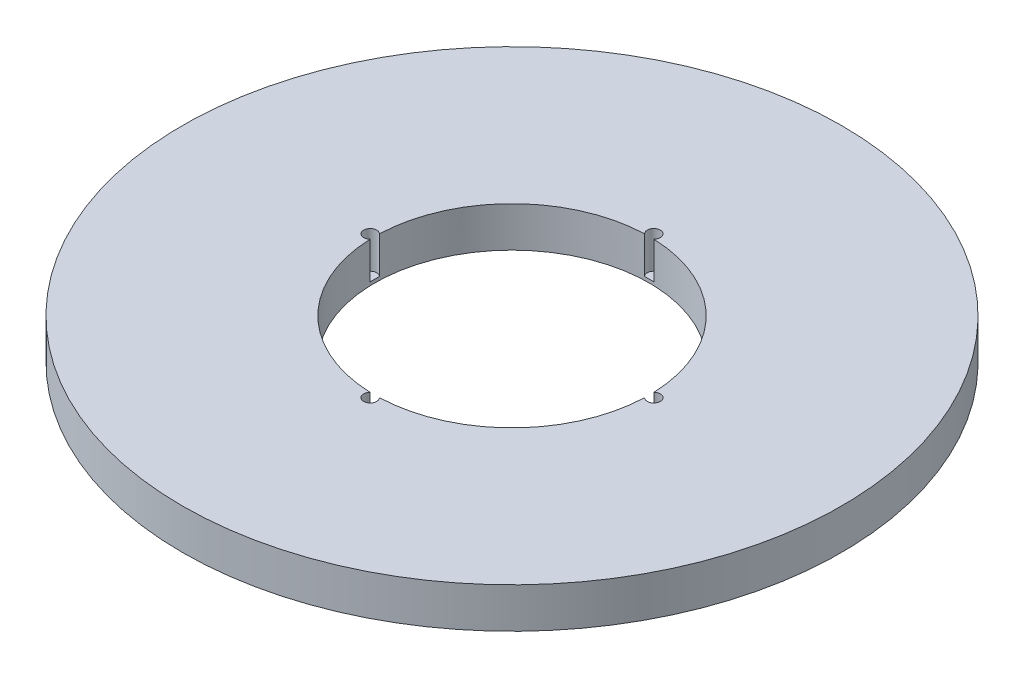
ISO-10303-21;
HEADER;
FILE_DESCRIPTION(('STEP AP214'),'2;1');
FILE_NAME('part.step','',(''),(''),'','','');
FILE_SCHEMA(('AUTOMOTIVE_DESIGN { 1 0 10303 214 1 1 1 1 }'));
ENDSEC;
DATA;
#1=APPLICATION_CONTEXT('core data for automotive mechanical design processes');
#2=APPLICATION_PROTOCOL_DEFINITION('international standard','automotive_design',2000,#1);
#3=PRODUCT_CONTEXT('',#1,'mechanical');
#4=PRODUCT('Part','Part','',(#3));
#5=PRODUCT_RELATED_PRODUCT_CATEGORY('part','',(#4));
#6=PRODUCT_DEFINITION_FORMATION('','',#4);
#7=PRODUCT_DEFINITION_CONTEXT('part definition',#1,'design');
#8=PRODUCT_DEFINITION('design','',#6,#7);
#9=PRODUCT_DEFINITION_SHAPE('','',#8);
#10=(LENGTH_UNIT() NAMED_UNIT(*) SI_UNIT(.MILLI.,.METRE.));
#11=(NAMED_UNIT(*) PLANE_ANGLE_UNIT() SI_UNIT($,.RADIAN.));
#12=(NAMED_UNIT(*) SI_UNIT($,.STERADIAN.) SOLID_ANGLE_UNIT());
#13=UNCERTAINTY_MEASURE_WITH_UNIT(LENGTH_MEASURE(1.E-05),#10,'distance_accuracy_value','');
#14=(GEOMETRIC_REPRESENTATION_CONTEXT(3) GLOBAL_UNCERTAINTY_ASSIGNED_CONTEXT((#13)) GLOBAL_UNIT_ASSIGNED_CONTEXT((#10,
#11,#12)) REPRESENTATION_CONTEXT('',''));
#15=CARTESIAN_POINT('',(0.,0.,0.));
#16=DIRECTION('',(0.,0.,1.));
#17=DIRECTION('',(1.,0.,0.));
#18=AXIS2_PLACEMENT_3D('',#15,#16,#17);
#19=CARTESIAN_POINT('',(0.,11.,0.));
#20=DIRECTION('',(0.,-1.,0.));
#21=DIRECTION('',(0.,0.,-1.));
#22=AXIS2_PLACEMENT_3D('',#19,#20,#21);
#23=CYLINDRICAL_SURFACE('',#22,90.);
#24=CARTESIAN_POINT('',(0.,11.,0.));
#25=DIRECTION('',(0.,1.,0.));
#26=DIRECTION('',(0.,0.,1.));
#27=AXIS2_PLACEMENT_3D('',#24,#25,#26);
#28=CIRCLE('',#27,90.);
#29=CARTESIAN_POINT('',(0.,11.,90.));
#30=VERTEX_POINT('',#29);
#31=EDGE_CURVE('E145',#30,#30,#28,.T.);
#32=ORIENTED_EDGE('',*,*,#31,.F.);
#33=EDGE_LOOP('',(#32));
#34=FACE_BOUND('',#33,.T.);
#35=CARTESIAN_POINT('',(0.,0.,0.));
#36=DIRECTION('',(0.,1.,0.));
#37=DIRECTION('',(0.,0.,1.));
#38=AXIS2_PLACEMENT_3D('',#35,#36,#37);
#39=CIRCLE('',#38,90.);
#40=CARTESIAN_POINT('',(0.,0.,90.));
#41=VERTEX_POINT('',#40);
#42=EDGE_CURVE('E143',#41,#41,#39,.T.);
#43=ORIENTED_EDGE('',*,*,#42,.T.);
#44=EDGE_LOOP('',(#43));
#45=FACE_BOUND('',#44,.T.);
#46=ADVANCED_FACE('F39',(#34,#45),#23,.T.);
#47=CARTESIAN_POINT('',(0.,11.,0.));
#48=DIRECTION('',(0.,1.,0.));
#49=DIRECTION('',(0.,0.,1.));
#50=AXIS2_PLACEMENT_3D('',#47,#48,#49);
#51=PLANE('',#50);
#52=CARTESIAN_POINT('',(1.35209274207174E-13,11.,38.7254752597286));
#53=DIRECTION('',(0.,1.,0.));
#54=DIRECTION('',(1.,0.,0.));
#55=AXIS2_PLACEMENT_3D('',#52,#53,#54);
#56=CIRCLE('',#55,1.79084642130694);
#57=CARTESIAN_POINT('',(-1.28486988663369,11.,37.4779816608955));
#58=VERTEX_POINT('',#57);
#59=CARTESIAN_POINT('',(1.28486988663395,11.,37.4779816608955));
#60=VERTEX_POINT('',#59);
#61=EDGE_CURVE('E152',#58,#60,#56,.T.);
#62=ORIENTED_EDGE('',*,*,#61,.F.);
#63=CARTESIAN_POINT('',(0.,11.,0.));
#64=DIRECTION('',(0.,1.,0.));
#65=DIRECTION('',(0.,0.,1.));
#66=AXIS2_PLACEMENT_3D('',#63,#64,#65);
#67=CIRCLE('',#66,37.5);
#68=CARTESIAN_POINT('',(-37.4779816608955,11.,1.28486988663382));
#69=VERTEX_POINT('',#68);
#70=EDGE_CURVE('E133',#69,#58,#67,.T.);
#71=ORIENTED_EDGE('',*,*,#70,.F.);
#72=CARTESIAN_POINT('',(-38.7254752597286,11.,0.));
#73=DIRECTION('',(0.,1.,0.));
#74=DIRECTION('',(0.,0.,1.));
#75=AXIS2_PLACEMENT_3D('',#72,#73,#74);
#76=CIRCLE('',#75,1.79084642130694);
#77=CARTESIAN_POINT('',(-37.4779816608955,11.,-1.28486988663382));
#78=VERTEX_POINT('',#77);
#79=EDGE_CURVE('E128',#78,#69,#76,.T.);
#80=ORIENTED_EDGE('',*,*,#79,.F.);
#81=CARTESIAN_POINT('',(-1.28486988663421,11.,-37.4779816608955));
#82=VERTEX_POINT('',#81);
#83=EDGE_CURVE('E121',#82,#78,#67,.T.);
#84=ORIENTED_EDGE('',*,*,#83,.F.);
#85=CARTESIAN_POINT('',(-4.05627822621521E-13,11.,-38.7254752597286));
#86=DIRECTION('',(0.,1.,0.));
#87=DIRECTION('',(-1.,0.,0.));
#88=AXIS2_PLACEMENT_3D('',#85,#86,#87);
#89=CIRCLE('',#88,1.79084642130694);
#90=CARTESIAN_POINT('',(1.28486988663343,11.,-37.4779816608955));
#91=VERTEX_POINT('',#90);
#92=EDGE_CURVE('E105',#91,#82,#89,.T.);
#93=ORIENTED_EDGE('',*,*,#92,.F.);
#94=CARTESIAN_POINT('',(37.4779816608955,11.,-1.28486988663382));
#95=VERTEX_POINT('',#94);
#96=EDGE_CURVE('E131',#95,#91,#67,.T.);
#97=ORIENTED_EDGE('',*,*,#96,.F.);
#98=CARTESIAN_POINT('',(38.7254752597286,11.,0.));
#99=DIRECTION('',(0.,1.,0.));
#100=DIRECTION('',(0.,0.,-1.));
#101=AXIS2_PLACEMENT_3D('',#98,#99,#100);
#102=CIRCLE('',#101,1.79084642130694);
#103=CARTESIAN_POINT('',(37.4779816608955,11.,1.28486988663382));
#104=VERTEX_POINT('',#103);
#105=EDGE_CURVE('E154',#104,#95,#102,.T.);
#106=ORIENTED_EDGE('',*,*,#105,.F.);
#107=EDGE_CURVE('E134',#60,#104,#67,.T.);
#108=ORIENTED_EDGE('',*,*,#107,.F.);
#109=EDGE_LOOP('',(#62,#71,#80,#84,#93,#97,#106,#108));
#110=FACE_BOUND('',#109,.T.);
#111=ORIENTED_EDGE('',*,*,#31,.T.);
#112=EDGE_LOOP('',(#111));
#113=FACE_BOUND('',#112,.T.);
#114=ADVANCED_FACE('F130',(#110,#113),#51,.T.);
#115=CARTESIAN_POINT('',(0.,0.,0.));
#116=DIRECTION('',(0.,1.,0.));
#117=DIRECTION('',(0.,0.,1.));
#118=AXIS2_PLACEMENT_3D('',#115,#116,#117);
#119=PLANE('',#118);
#120=CARTESIAN_POINT('',(0.,0.,0.));
#121=DIRECTION('',(0.,1.,0.));
#122=DIRECTION('',(0.,0.,1.));
#123=AXIS2_PLACEMENT_3D('',#120,#121,#122);
#124=CIRCLE('',#123,37.5);
#125=CARTESIAN_POINT('',(0.,0.,37.5));
#126=VERTEX_POINT('',#125);
#127=EDGE_CURVE('E135',#126,#126,#124,.T.);
#128=ORIENTED_EDGE('',*,*,#127,.T.);
#129=EDGE_LOOP('',(#128));
#130=FACE_BOUND('',#129,.T.);
#131=ORIENTED_EDGE('',*,*,#42,.F.);
#132=EDGE_LOOP('',(#131));
#133=FACE_BOUND('',#132,.T.);
#134=ADVANCED_FACE('F195',(#130,#133),#119,.F.);
#135=CARTESIAN_POINT('',(0.,11.,0.));
#136=DIRECTION('',(0.,-1.,0.));
#137=DIRECTION('',(0.,0.,-1.));
#138=AXIS2_PLACEMENT_3D('',#135,#136,#137);
#139=CYLINDRICAL_SURFACE('',#138,37.5);
#140=DIRECTION('',(0.,1.,0.));
#141=VECTOR('',#140,1.);
#142=CARTESIAN_POINT('',(-1.2848698866337,5.95215456891497,37.4779816608955));
#143=LINE('',#142,#141);
#144=CARTESIAN_POINT('',(-1.28486988663369,0.904309137829934,37.4779816608955));
#145=VERTEX_POINT('',#144);
#146=EDGE_CURVE('E11',#145,#58,#143,.T.);
#147=ORIENTED_EDGE('',*,*,#146,.F.);
#148=CARTESIAN_POINT('',(0.,0.904309137829934,0.));
#149=DIRECTION('',(0.,1.,0.));
#150=DIRECTION('',(0.,0.,1.));
#151=AXIS2_PLACEMENT_3D('',#148,#149,#150);
#152=CIRCLE('',#151,37.5);
#153=CARTESIAN_POINT('',(1.28486988663395,0.904309137829934,37.4779816608955));
#154=VERTEX_POINT('',#153);
#155=EDGE_CURVE('E169',#145,#154,#152,.T.);
#156=ORIENTED_EDGE('',*,*,#155,.T.);
#157=DIRECTION('',(0.,1.,0.));
#158=VECTOR('',#157,1.);
#159=CARTESIAN_POINT('',(1.28486988663396,5.95215456891497,37.4779816608955));
#160=LINE('',#159,#158);
#161=EDGE_CURVE('E46',#60,#154,#160,.F.);
#162=ORIENTED_EDGE('',*,*,#161,.F.);
#163=ORIENTED_EDGE('',*,*,#107,.T.);
#164=DIRECTION('',(0.,1.,0.));
#165=VECTOR('',#164,1.);
#166=CARTESIAN_POINT('',(37.4779816608955,5.95215456891497,1.28486988663383));
#167=LINE('',#166,#165);
#168=CARTESIAN_POINT('',(37.4779816608955,0.904309137829934,1.28486988663382));
#169=VERTEX_POINT('',#168);
#170=EDGE_CURVE('E151',#169,#104,#167,.T.);
#171=ORIENTED_EDGE('',*,*,#170,.F.);
#172=CARTESIAN_POINT('',(0.,0.904309137829934,0.));
#173=DIRECTION('',(0.,1.,0.));
#174=DIRECTION('',(0.,0.,1.));
#175=AXIS2_PLACEMENT_3D('',#172,#173,#174);
#176=CIRCLE('',#175,37.5);
#177=CARTESIAN_POINT('',(37.4779816608955,0.904309137829934,-1.28486988663382));
#178=VERTEX_POINT('',#177);
#179=EDGE_CURVE('E173',#169,#178,#176,.T.);
#180=ORIENTED_EDGE('',*,*,#179,.T.);
#181=DIRECTION('',(0.,1.,0.));
#182=VECTOR('',#181,1.);
#183=CARTESIAN_POINT('',(37.4779816608955,5.95215456891497,-1.28486988663383));
#184=LINE('',#183,#182);
#185=EDGE_CURVE('E168',#95,#178,#184,.F.);
#186=ORIENTED_EDGE('',*,*,#185,.F.);
#187=ORIENTED_EDGE('',*,*,#96,.T.);
#188=DIRECTION('',(0.,1.,0.));
#189=VECTOR('',#188,1.);
#190=CARTESIAN_POINT('',(1.28486988663344,5.95215456891497,-37.4779816608956));
#191=LINE('',#190,#189);
#192=CARTESIAN_POINT('',(1.28486988663343,0.904309137829934,-37.4779816608955));
#193=VERTEX_POINT('',#192);
#194=EDGE_CURVE('E108',#193,#91,#191,.T.);
#195=ORIENTED_EDGE('',*,*,#194,.F.);
#196=CARTESIAN_POINT('',(0.,0.904309137829934,0.));
#197=DIRECTION('',(0.,1.,0.));
#198=DIRECTION('',(0.,0.,1.));
#199=AXIS2_PLACEMENT_3D('',#196,#197,#198);
#200=CIRCLE('',#199,37.5);
#201=CARTESIAN_POINT('',(-1.28486988663421,0.904309137829934,-37.4779816608955));
#202=VERTEX_POINT('',#201);
#203=EDGE_CURVE('E122',#193,#202,#200,.T.);
#204=ORIENTED_EDGE('',*,*,#203,.T.);
#205=DIRECTION('',(0.,1.,0.));
#206=VECTOR('',#205,1.);
#207=CARTESIAN_POINT('',(-1.28486988663422,5.95215456891497,-37.4779816608955));
#208=LINE('',#207,#206);
#209=EDGE_CURVE('E106',#82,#202,#208,.F.);
#210=ORIENTED_EDGE('',*,*,#209,.F.);
#211=ORIENTED_EDGE('',*,*,#83,.T.);
#212=DIRECTION('',(0.,1.,0.));
#213=VECTOR('',#212,1.);
#214=CARTESIAN_POINT('',(-37.4779816608955,5.95215456891497,-1.28486988663383));
#215=LINE('',#214,#213);
#216=CARTESIAN_POINT('',(-37.4779816608955,0.904309137829934,-1.28486988663382));
#217=VERTEX_POINT('',#216);
#218=EDGE_CURVE('E177',#217,#78,#215,.T.);
#219=ORIENTED_EDGE('',*,*,#218,.F.);
#220=CARTESIAN_POINT('',(0.,0.904309137829934,0.));
#221=DIRECTION('',(0.,1.,0.));
#222=DIRECTION('',(0.,0.,1.));
#223=AXIS2_PLACEMENT_3D('',#220,#221,#222);
#224=CIRCLE('',#223,37.5);
#225=CARTESIAN_POINT('',(-37.4779816608955,0.904309137829934,1.28486988663382));
#226=VERTEX_POINT('',#225);
#227=EDGE_CURVE('E185',#217,#226,#224,.T.);
#228=ORIENTED_EDGE('',*,*,#227,.T.);
#229=DIRECTION('',(0.,1.,0.));
#230=VECTOR('',#229,1.);
#231=CARTESIAN_POINT('',(-37.4779816608955,5.95215456891497,1.28486988663383));
#232=LINE('',#231,#230);
#233=EDGE_CURVE('E179',#69,#226,#232,.F.);
#234=ORIENTED_EDGE('',*,*,#233,.F.);
#235=ORIENTED_EDGE('',*,*,#70,.T.);
#236=EDGE_LOOP('',(#147,#156,#162,#163,#171,#180,#186,#187,#195,#204,#210,#211,#219,#228,#234,#235));
#237=FACE_BOUND('',#236,.T.);
#238=ORIENTED_EDGE('',*,*,#127,.F.);
#239=EDGE_LOOP('',(#238));
#240=FACE_BOUND('',#239,.T.);
#241=ADVANCED_FACE('F117',(#237,#240),#139,.F.);
#242=CARTESIAN_POINT('',(-38.7254752597286,0.904309137829934,0.));
#243=DIRECTION('',(0.,1.,0.));
#244=DIRECTION('',(0.,0.,1.));
#245=AXIS2_PLACEMENT_3D('',#242,#243,#244);
#246=CYLINDRICAL_SURFACE('',#245,1.79084642130694);
#247=ORIENTED_EDGE('',*,*,#218,.T.);
#248=ORIENTED_EDGE('',*,*,#79,.T.);
#249=ORIENTED_EDGE('',*,*,#233,.T.);
#250=CARTESIAN_POINT('',(-38.7254752597286,0.904309137829934,0.));
#251=DIRECTION('',(0.,1.,0.));
#252=DIRECTION('',(0.,0.,1.));
#253=AXIS2_PLACEMENT_3D('',#250,#251,#252);
#254=CIRCLE('',#253,1.79084642130694);
#255=EDGE_CURVE('E140',#217,#226,#254,.T.);
#256=ORIENTED_EDGE('',*,*,#255,.F.);
#257=EDGE_LOOP('',(#247,#248,#249,#256));
#258=FACE_BOUND('',#257,.T.);
#259=ADVANCED_FACE('F200',(#258),#246,.F.);
#260=CARTESIAN_POINT('',(-38.7254752597286,0.904309137829934,0.));
#261=DIRECTION('',(0.,1.,0.));
#262=DIRECTION('',(0.,0.,1.));
#263=AXIS2_PLACEMENT_3D('',#260,#261,#262);
#264=PLANE('',#263);
#265=ORIENTED_EDGE('',*,*,#255,.T.);
#266=ORIENTED_EDGE('',*,*,#227,.F.);
#267=EDGE_LOOP('',(#265,#266));
#268=FACE_BOUND('',#267,.T.);
#269=ADVANCED_FACE('F202',(#268),#264,.T.);
#270=CARTESIAN_POINT('',(-4.05627822621521E-13,0.904309137829934,-38.7254752597286));
#271=DIRECTION('',(0.,1.,0.));
#272=DIRECTION('',(0.,0.,1.));
#273=AXIS2_PLACEMENT_3D('',#270,#271,#272);
#274=CYLINDRICAL_SURFACE('',#273,1.79084642130694);
#275=ORIENTED_EDGE('',*,*,#194,.T.);
#276=ORIENTED_EDGE('',*,*,#92,.T.);
#277=ORIENTED_EDGE('',*,*,#209,.T.);
#278=CARTESIAN_POINT('',(-4.05627822621521E-13,0.904309137829934,-38.7254752597286));
#279=DIRECTION('',(0.,1.,0.));
#280=DIRECTION('',(-1.,0.,0.));
#281=AXIS2_PLACEMENT_3D('',#278,#279,#280);
#282=CIRCLE('',#281,1.79084642130694);
#283=EDGE_CURVE('E111',#193,#202,#282,.T.);
#284=ORIENTED_EDGE('',*,*,#283,.F.);
#285=EDGE_LOOP('',(#275,#276,#277,#284));
#286=FACE_BOUND('',#285,.T.);
#287=ADVANCED_FACE('F102',(#286),#274,.F.);
#288=CARTESIAN_POINT('',(-4.05627822621521E-13,0.904309137829934,-38.7254752597286));
#289=DIRECTION('',(0.,1.,0.));
#290=DIRECTION('',(-1.,0.,0.));
#291=AXIS2_PLACEMENT_3D('',#288,#289,#290);
#292=PLANE('',#291);
#293=ORIENTED_EDGE('',*,*,#283,.T.);
#294=ORIENTED_EDGE('',*,*,#203,.F.);
#295=EDGE_LOOP('',(#293,#294));
#296=FACE_BOUND('',#295,.T.);
#297=ADVANCED_FACE('F211',(#296),#292,.T.);
#298=CARTESIAN_POINT('',(38.7254752597286,0.904309137829934,0.));
#299=DIRECTION('',(0.,1.,0.));
#300=DIRECTION('',(0.,0.,1.));
#301=AXIS2_PLACEMENT_3D('',#298,#299,#300);
#302=CYLINDRICAL_SURFACE('',#301,1.79084642130694);
#303=ORIENTED_EDGE('',*,*,#170,.T.);
#304=ORIENTED_EDGE('',*,*,#105,.T.);
#305=ORIENTED_EDGE('',*,*,#185,.T.);
#306=CARTESIAN_POINT('',(38.7254752597286,0.904309137829934,0.));
#307=DIRECTION('',(0.,1.,0.));
#308=DIRECTION('',(0.,0.,-1.));
#309=AXIS2_PLACEMENT_3D('',#306,#307,#308);
#310=CIRCLE('',#309,1.79084642130694);
#311=EDGE_CURVE('E56',#169,#178,#310,.T.);
#312=ORIENTED_EDGE('',*,*,#311,.F.);
#313=EDGE_LOOP('',(#303,#304,#305,#312));
#314=FACE_BOUND('',#313,.T.);
#315=ADVANCED_FACE('F212',(#314),#302,.F.);
#316=CARTESIAN_POINT('',(38.7254752597286,0.904309137829934,0.));
#317=DIRECTION('',(0.,1.,0.));
#318=DIRECTION('',(0.,0.,-1.));
#319=AXIS2_PLACEMENT_3D('',#316,#317,#318);
#320=PLANE('',#319);
#321=ORIENTED_EDGE('',*,*,#311,.T.);
#322=ORIENTED_EDGE('',*,*,#179,.F.);
#323=EDGE_LOOP('',(#321,#322));
#324=FACE_BOUND('',#323,.T.);
#325=ADVANCED_FACE('F217',(#324),#320,.T.);
#326=CARTESIAN_POINT('',(1.35209274207174E-13,0.904309137829934,38.7254752597286));
#327=DIRECTION('',(0.,1.,0.));
#328=DIRECTION('',(0.,0.,1.));
#329=AXIS2_PLACEMENT_3D('',#326,#327,#328);
#330=CYLINDRICAL_SURFACE('',#329,1.79084642130694);
#331=ORIENTED_EDGE('',*,*,#146,.T.);
#332=ORIENTED_EDGE('',*,*,#61,.T.);
#333=ORIENTED_EDGE('',*,*,#161,.T.);
#334=CARTESIAN_POINT('',(1.35209274207174E-13,0.904309137829934,38.7254752597286));
#335=DIRECTION('',(0.,1.,0.));
#336=DIRECTION('',(1.,0.,0.));
#337=AXIS2_PLACEMENT_3D('',#334,#335,#336);
#338=CIRCLE('',#337,1.79084642130694);
#339=EDGE_CURVE('E55',#145,#154,#338,.T.);
#340=ORIENTED_EDGE('',*,*,#339,.F.);
#341=EDGE_LOOP('',(#331,#332,#333,#340));
#342=FACE_BOUND('',#341,.T.);
#343=ADVANCED_FACE('F170',(#342),#330,.F.);
#344=CARTESIAN_POINT('',(1.35209274207174E-13,0.904309137829934,38.7254752597286));
#345=DIRECTION('',(0.,1.,0.));
#346=DIRECTION('',(1.,0.,0.));
#347=AXIS2_PLACEMENT_3D('',#344,#345,#346);
#348=PLANE('',#347);
#349=ORIENTED_EDGE('',*,*,#339,.T.);
#350=ORIENTED_EDGE('',*,*,#155,.F.);
#351=EDGE_LOOP('',(#349,#350));
#352=FACE_BOUND('',#351,.T.);
#353=ADVANCED_FACE('F224',(#352),#348,.T.);
#354=CLOSED_SHELL('',(#46,#114,#134,#241,#259,#269,#287,#297,#315,#325,#343,#353));
#355=MANIFOLD_SOLID_BREP('B2',#354);
#356=ADVANCED_BREP_SHAPE_REPRESENTATION('',(#18,#355),#14);
#357=SHAPE_DEFINITION_REPRESENTATION(#9,#356);
ENDSEC;
END-ISO-10303-21;
